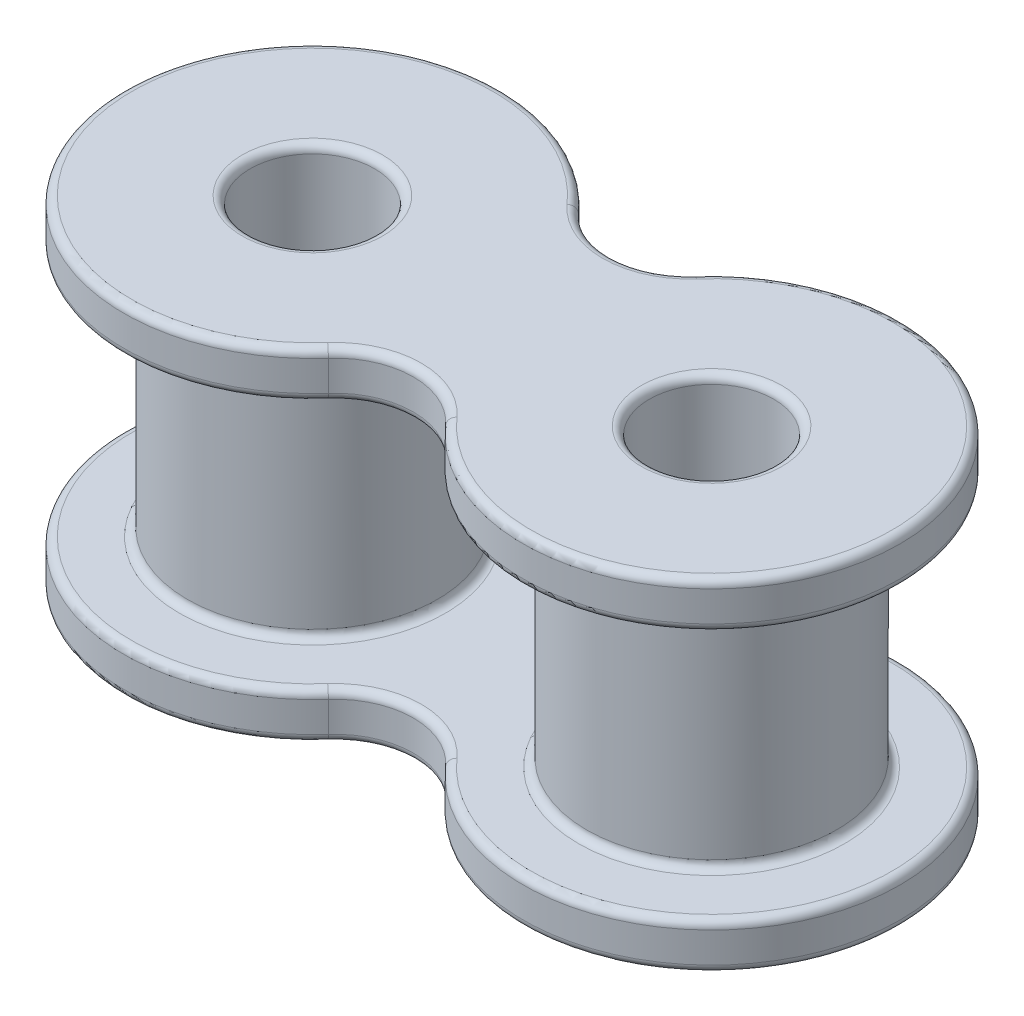
ISO-10303-21;
HEADER;
FILE_DESCRIPTION(('STEP AP214'),'2;1');
FILE_NAME('part.step','',(''),(''),'','','');
FILE_SCHEMA(('AUTOMOTIVE_DESIGN { 1 0 10303 214 1 1 1 1 }'));
ENDSEC;
DATA;
#1=APPLICATION_CONTEXT('core data for automotive mechanical design processes');
#2=APPLICATION_PROTOCOL_DEFINITION('international standard','automotive_design',2000,#1);
#3=PRODUCT_CONTEXT('',#1,'mechanical');
#4=PRODUCT('Part','Part','',(#3));
#5=PRODUCT_RELATED_PRODUCT_CATEGORY('part','',(#4));
#6=PRODUCT_DEFINITION_FORMATION('','',#4);
#7=PRODUCT_DEFINITION_CONTEXT('part definition',#1,'design');
#8=PRODUCT_DEFINITION('design','',#6,#7);
#9=PRODUCT_DEFINITION_SHAPE('','',#8);
#10=(LENGTH_UNIT() NAMED_UNIT(*) SI_UNIT(.MILLI.,.METRE.));
#11=(NAMED_UNIT(*) PLANE_ANGLE_UNIT() SI_UNIT($,.RADIAN.));
#12=(NAMED_UNIT(*) SI_UNIT($,.STERADIAN.) SOLID_ANGLE_UNIT());
#13=UNCERTAINTY_MEASURE_WITH_UNIT(LENGTH_MEASURE(1.E-05),#10,'distance_accuracy_value','');
#14=(GEOMETRIC_REPRESENTATION_CONTEXT(3) GLOBAL_UNCERTAINTY_ASSIGNED_CONTEXT((#13)) GLOBAL_UNIT_ASSIGNED_CONTEXT((#10,
#11,#12)) REPRESENTATION_CONTEXT('',''));
#15=CARTESIAN_POINT('',(0.,0.,0.));
#16=DIRECTION('',(0.,0.,1.));
#17=DIRECTION('',(1.,0.,0.));
#18=AXIS2_PLACEMENT_3D('',#15,#16,#17);
#19=CARTESIAN_POINT('',(3.175,0.7366,-2.81610900547326));
#20=DIRECTION('',(0.,1.,0.));
#21=DIRECTION('',(0.,0.,1.));
#22=AXIS2_PLACEMENT_3D('',#19,#20,#21);
#23=PLANE('',#22);
#24=CARTESIAN_POINT('',(-6.35,0.7366,0.));
#25=DIRECTION('',(0.,1.,0.));
#26=DIRECTION('',(0.,0.,1.));
#27=AXIS2_PLACEMENT_3D('',#24,#25,#26);
#28=CIRCLE('',#27,4.2291);
#29=CARTESIAN_POINT('',(-6.35,0.7366,4.2291));
#30=VERTEX_POINT('',#29);
#31=EDGE_CURVE('E188',#30,#30,#28,.F.);
#32=ORIENTED_EDGE('',*,*,#31,.T.);
#33=EDGE_LOOP('',(#32));
#34=FACE_BOUND('',#33,.T.);
#35=CARTESIAN_POINT('',(6.35,0.7366,0.));
#36=DIRECTION('',(0.,1.,0.));
#37=DIRECTION('',(0.,0.,1.));
#38=AXIS2_PLACEMENT_3D('',#35,#36,#37);
#39=CIRCLE('',#38,4.2291);
#40=CARTESIAN_POINT('',(6.35,0.7366,4.2291));
#41=VERTEX_POINT('',#40);
#42=EDGE_CURVE('E185',#41,#41,#39,.F.);
#43=ORIENTED_EDGE('',*,*,#42,.T.);
#44=EDGE_LOOP('',(#43));
#45=FACE_BOUND('',#44,.T.);
#46=CARTESIAN_POINT('',(6.35,0.7366,0.));
#47=DIRECTION('',(0.,1.,0.));
#48=DIRECTION('',(0.,0.,1.));
#49=AXIS2_PLACEMENT_3D('',#46,#47,#48);
#50=CIRCLE('',#49,5.7404);
#51=CARTESIAN_POINT('',(2.05546815225198,0.7366,3.80909285377477));
#52=VERTEX_POINT('',#51);
#53=CARTESIAN_POINT('',(2.05546815225198,0.7366,-3.80909285377477));
#54=VERTEX_POINT('',#53);
#55=EDGE_CURVE('E183',#52,#54,#50,.T.);
#56=ORIENTED_EDGE('',*,*,#55,.T.);
#57=CARTESIAN_POINT('',(0.,0.7366,-5.63221801094651));
#58=DIRECTION('',(0.,1.,0.));
#59=DIRECTION('',(0.,0.,1.));
#60=AXIS2_PLACEMENT_3D('',#57,#58,#59);
#61=CIRCLE('',#60,2.74749607163225);
#62=CARTESIAN_POINT('',(-2.05546815225198,0.7366,-3.80909285377477));
#63=VERTEX_POINT('',#62);
#64=EDGE_CURVE('E164',#54,#63,#61,.F.);
#65=ORIENTED_EDGE('',*,*,#64,.T.);
#66=CARTESIAN_POINT('',(-6.35,0.7366,0.));
#67=DIRECTION('',(0.,1.,0.));
#68=DIRECTION('',(0.,0.,1.));
#69=AXIS2_PLACEMENT_3D('',#66,#67,#68);
#70=CIRCLE('',#69,5.7404);
#71=CARTESIAN_POINT('',(-2.05546815225198,0.7366,3.80909285377477));
#72=VERTEX_POINT('',#71);
#73=EDGE_CURVE('E173',#63,#72,#70,.T.);
#74=ORIENTED_EDGE('',*,*,#73,.T.);
#75=CARTESIAN_POINT('',(0.,0.7366,5.63221801094651));
#76=DIRECTION('',(0.,1.,0.));
#77=DIRECTION('',(0.,0.,1.));
#78=AXIS2_PLACEMENT_3D('',#75,#76,#77);
#79=CIRCLE('',#78,2.74749607163225);
#80=EDGE_CURVE('E179',#72,#52,#79,.F.);
#81=ORIENTED_EDGE('',*,*,#80,.T.);
#82=EDGE_LOOP('',(#56,#65,#74,#81));
#83=FACE_BOUND('',#82,.T.);
#84=ADVANCED_FACE('F41',(#34,#45,#83),#23,.T.);
#85=CARTESIAN_POINT('',(3.175,-0.7366,-2.81610900547326));
#86=DIRECTION('',(0.,1.,0.));
#87=DIRECTION('',(0.,0.,1.));
#88=AXIS2_PLACEMENT_3D('',#85,#86,#87);
#89=PLANE('',#88);
#90=CARTESIAN_POINT('',(6.35,-0.7366,0.));
#91=DIRECTION('',(0.,1.,0.));
#92=DIRECTION('',(0.,0.,1.));
#93=AXIS2_PLACEMENT_3D('',#90,#91,#92);
#94=CIRCLE('',#93,2.2352);
#95=CARTESIAN_POINT('',(6.35,-0.7366,2.2352));
#96=VERTEX_POINT('',#95);
#97=EDGE_CURVE('E223',#96,#96,#94,.T.);
#98=ORIENTED_EDGE('',*,*,#97,.T.);
#99=EDGE_LOOP('',(#98));
#100=FACE_BOUND('',#99,.T.);
#101=CARTESIAN_POINT('',(-6.35,-0.7366,0.));
#102=DIRECTION('',(0.,1.,0.));
#103=DIRECTION('',(0.,0.,1.));
#104=AXIS2_PLACEMENT_3D('',#101,#102,#103);
#105=CIRCLE('',#104,2.2352);
#106=CARTESIAN_POINT('',(-6.35,-0.7366,2.2352));
#107=VERTEX_POINT('',#106);
#108=EDGE_CURVE('E220',#107,#107,#105,.T.);
#109=ORIENTED_EDGE('',*,*,#108,.T.);
#110=EDGE_LOOP('',(#109));
#111=FACE_BOUND('',#110,.T.);
#112=CARTESIAN_POINT('',(0.,-0.7366,5.63221801094651));
#113=DIRECTION('',(0.,1.,0.));
#114=DIRECTION('',(0.,0.,1.));
#115=AXIS2_PLACEMENT_3D('',#112,#113,#114);
#116=CIRCLE('',#115,2.74749607163225);
#117=CARTESIAN_POINT('',(2.05546815225198,-0.7366,3.80909285377476));
#118=VERTEX_POINT('',#117);
#119=CARTESIAN_POINT('',(-2.05546815225198,-0.7366,3.80909285377476));
#120=VERTEX_POINT('',#119);
#121=EDGE_CURVE('E213',#118,#120,#116,.T.);
#122=ORIENTED_EDGE('',*,*,#121,.T.);
#123=CARTESIAN_POINT('',(-6.35,-0.7366,0.));
#124=DIRECTION('',(0.,1.,0.));
#125=DIRECTION('',(0.,0.,1.));
#126=AXIS2_PLACEMENT_3D('',#123,#124,#125);
#127=CIRCLE('',#126,5.7404);
#128=CARTESIAN_POINT('',(-2.05546815225198,-0.7366,-3.80909285377477));
#129=VERTEX_POINT('',#128);
#130=EDGE_CURVE('E217',#120,#129,#127,.F.);
#131=ORIENTED_EDGE('',*,*,#130,.T.);
#132=CARTESIAN_POINT('',(0.,-0.7366,-5.63221801094651));
#133=DIRECTION('',(0.,1.,0.));
#134=DIRECTION('',(0.,0.,1.));
#135=AXIS2_PLACEMENT_3D('',#132,#133,#134);
#136=CIRCLE('',#135,2.74749607163225);
#137=CARTESIAN_POINT('',(2.05546815225198,-0.7366,-3.80909285377477));
#138=VERTEX_POINT('',#137);
#139=EDGE_CURVE('E215',#129,#138,#136,.T.);
#140=ORIENTED_EDGE('',*,*,#139,.T.);
#141=CARTESIAN_POINT('',(6.35,-0.7366,0.));
#142=DIRECTION('',(0.,1.,0.));
#143=DIRECTION('',(0.,0.,1.));
#144=AXIS2_PLACEMENT_3D('',#141,#142,#143);
#145=CIRCLE('',#144,5.7404);
#146=EDGE_CURVE('E211',#138,#118,#145,.F.);
#147=ORIENTED_EDGE('',*,*,#146,.T.);
#148=EDGE_LOOP('',(#122,#131,#140,#147));
#149=FACE_BOUND('',#148,.T.);
#150=ADVANCED_FACE('F391',(#100,#111,#149),#89,.F.);
#151=CARTESIAN_POINT('',(0.,0.7366,-5.63221801094651));
#152=DIRECTION('',(0.,-1.,0.));
#153=DIRECTION('',(0.,0.,-1.));
#154=AXIS2_PLACEMENT_3D('',#151,#152,#153);
#155=CYLINDRICAL_SURFACE('',#154,2.49349607163225);
#156=DIRECTION('',(0.,-1.,0.));
#157=VECTOR('',#156,1.);
#158=CARTESIAN_POINT('',(-1.86544461916579,0.7366,-3.97763678535772));
#159=LINE('',#158,#157);
#160=CARTESIAN_POINT('',(-1.86544461916579,0.4826,-3.97763678535772));
#161=VERTEX_POINT('',#160);
#162=CARTESIAN_POINT('',(-1.86544461916579,-0.4826,-3.97763678535772));
#163=VERTEX_POINT('',#162);
#164=EDGE_CURVE('E180',#161,#163,#159,.T.);
#165=ORIENTED_EDGE('',*,*,#164,.F.);
#166=CARTESIAN_POINT('',(0.,0.4826,-5.63221801094651));
#167=DIRECTION('',(0.,1.,0.));
#168=DIRECTION('',(0.,0.,1.));
#169=AXIS2_PLACEMENT_3D('',#166,#167,#168);
#170=CIRCLE('',#169,2.49349607163225);
#171=CARTESIAN_POINT('',(1.86544461916579,0.4826,-3.97763678535772));
#172=VERTEX_POINT('',#171);
#173=EDGE_CURVE('E166',#161,#172,#170,.T.);
#174=ORIENTED_EDGE('',*,*,#173,.T.);
#175=DIRECTION('',(0.,-1.,0.));
#176=VECTOR('',#175,1.);
#177=CARTESIAN_POINT('',(1.86544461916579,0.7366,-3.97763678535772));
#178=LINE('',#177,#176);
#179=CARTESIAN_POINT('',(1.86544461916579,-0.4826,-3.97763678535772));
#180=VERTEX_POINT('',#179);
#181=EDGE_CURVE('E244',#172,#180,#178,.T.);
#182=ORIENTED_EDGE('',*,*,#181,.T.);
#183=CARTESIAN_POINT('',(0.,-0.4826,-5.63221801094651));
#184=DIRECTION('',(0.,1.,0.));
#185=DIRECTION('',(0.,0.,1.));
#186=AXIS2_PLACEMENT_3D('',#183,#184,#185);
#187=CIRCLE('',#186,2.49349607163225);
#188=EDGE_CURVE('E195',#180,#163,#187,.F.);
#189=ORIENTED_EDGE('',*,*,#188,.T.);
#190=EDGE_LOOP('',(#165,#174,#182,#189));
#191=FACE_BOUND('',#190,.T.);
#192=ADVANCED_FACE('F375',(#191),#155,.F.);
#193=CARTESIAN_POINT('',(-6.35,0.7366,0.));
#194=DIRECTION('',(0.,-1.,0.));
#195=DIRECTION('',(0.,0.,-1.));
#196=AXIS2_PLACEMENT_3D('',#193,#194,#195);
#197=CYLINDRICAL_SURFACE('',#196,5.9944);
#198=ORIENTED_EDGE('',*,*,#164,.T.);
#199=CARTESIAN_POINT('',(-6.35,-0.4826,0.));
#200=DIRECTION('',(0.,1.,0.));
#201=DIRECTION('',(0.,0.,1.));
#202=AXIS2_PLACEMENT_3D('',#199,#200,#201);
#203=CIRCLE('',#202,5.9944);
#204=CARTESIAN_POINT('',(-1.86544461916578,-0.4826,3.97763678535772));
#205=VERTEX_POINT('',#204);
#206=EDGE_CURVE('E208',#163,#205,#203,.T.);
#207=ORIENTED_EDGE('',*,*,#206,.T.);
#208=DIRECTION('',(0.,-1.,0.));
#209=VECTOR('',#208,1.);
#210=CARTESIAN_POINT('',(-1.86544461916578,0.7366,3.97763678535772));
#211=LINE('',#210,#209);
#212=CARTESIAN_POINT('',(-1.86544461916578,0.4826,3.97763678535772));
#213=VERTEX_POINT('',#212);
#214=EDGE_CURVE('E359',#213,#205,#211,.T.);
#215=ORIENTED_EDGE('',*,*,#214,.F.);
#216=CARTESIAN_POINT('',(-6.35,0.4826,0.));
#217=DIRECTION('',(0.,1.,0.));
#218=DIRECTION('',(0.,0.,1.));
#219=AXIS2_PLACEMENT_3D('',#216,#217,#218);
#220=CIRCLE('',#219,5.9944);
#221=EDGE_CURVE('E206',#213,#161,#220,.F.);
#222=ORIENTED_EDGE('',*,*,#221,.T.);
#223=EDGE_LOOP('',(#198,#207,#215,#222));
#224=FACE_BOUND('',#223,.T.);
#225=ADVANCED_FACE('F400',(#224),#197,.T.);
#226=CARTESIAN_POINT('',(0.,0.7366,5.63221801094651));
#227=DIRECTION('',(0.,-1.,0.));
#228=DIRECTION('',(0.,0.,-1.));
#229=AXIS2_PLACEMENT_3D('',#226,#227,#228);
#230=CYLINDRICAL_SURFACE('',#229,2.49349607163225);
#231=DIRECTION('',(0.,-1.,0.));
#232=VECTOR('',#231,1.);
#233=CARTESIAN_POINT('',(1.86544461916579,0.7366,3.97763678535772));
#234=LINE('',#233,#232);
#235=CARTESIAN_POINT('',(1.86544461916579,0.4826,3.97763678535772));
#236=VERTEX_POINT('',#235);
#237=CARTESIAN_POINT('',(1.86544461916579,-0.4826,3.97763678535772));
#238=VERTEX_POINT('',#237);
#239=EDGE_CURVE('E356',#236,#238,#234,.T.);
#240=ORIENTED_EDGE('',*,*,#239,.F.);
#241=CARTESIAN_POINT('',(0.,0.4826,5.63221801094651));
#242=DIRECTION('',(0.,1.,0.));
#243=DIRECTION('',(0.,0.,1.));
#244=AXIS2_PLACEMENT_3D('',#241,#242,#243);
#245=CIRCLE('',#244,2.49349607163225);
#246=EDGE_CURVE('E204',#236,#213,#245,.T.);
#247=ORIENTED_EDGE('',*,*,#246,.T.);
#248=ORIENTED_EDGE('',*,*,#214,.T.);
#249=CARTESIAN_POINT('',(0.,-0.4826,5.63221801094651));
#250=DIRECTION('',(0.,1.,0.));
#251=DIRECTION('',(0.,0.,1.));
#252=AXIS2_PLACEMENT_3D('',#249,#250,#251);
#253=CIRCLE('',#252,2.49349607163225);
#254=EDGE_CURVE('E202',#205,#238,#253,.F.);
#255=ORIENTED_EDGE('',*,*,#254,.T.);
#256=EDGE_LOOP('',(#240,#247,#248,#255));
#257=FACE_BOUND('',#256,.T.);
#258=ADVANCED_FACE('F403',(#257),#230,.F.);
#259=CARTESIAN_POINT('',(6.35,0.7366,0.));
#260=DIRECTION('',(0.,-1.,0.));
#261=DIRECTION('',(0.,0.,-1.));
#262=AXIS2_PLACEMENT_3D('',#259,#260,#261);
#263=CYLINDRICAL_SURFACE('',#262,5.9944);
#264=ORIENTED_EDGE('',*,*,#181,.F.);
#265=CARTESIAN_POINT('',(6.35,0.4826,0.));
#266=DIRECTION('',(0.,1.,0.));
#267=DIRECTION('',(0.,0.,1.));
#268=AXIS2_PLACEMENT_3D('',#265,#266,#267);
#269=CIRCLE('',#268,5.9944);
#270=EDGE_CURVE('E200',#172,#236,#269,.F.);
#271=ORIENTED_EDGE('',*,*,#270,.T.);
#272=ORIENTED_EDGE('',*,*,#239,.T.);
#273=CARTESIAN_POINT('',(6.35,-0.4826,0.));
#274=DIRECTION('',(0.,1.,0.));
#275=DIRECTION('',(0.,0.,1.));
#276=AXIS2_PLACEMENT_3D('',#273,#274,#275);
#277=CIRCLE('',#276,5.9944);
#278=EDGE_CURVE('E198',#238,#180,#277,.T.);
#279=ORIENTED_EDGE('',*,*,#278,.T.);
#280=EDGE_LOOP('',(#264,#271,#272,#279));
#281=FACE_BOUND('',#280,.T.);
#282=ADVANCED_FACE('F377',(#281),#263,.T.);
#283=CARTESIAN_POINT('',(-6.35,0.7366,0.));
#284=DIRECTION('',(0.,-1.,0.));
#285=DIRECTION('',(0.,0.,-1.));
#286=AXIS2_PLACEMENT_3D('',#283,#284,#285);
#287=CYLINDRICAL_SURFACE('',#286,1.9812);
#288=CARTESIAN_POINT('',(-6.35,9.8806,0.));
#289=DIRECTION('',(0.,-1.,0.));
#290=DIRECTION('',(0.,0.,-1.));
#291=AXIS2_PLACEMENT_3D('',#288,#289,#290);
#292=CIRCLE('',#291,1.9812);
#293=CARTESIAN_POINT('',(-6.35,9.8806,-1.9812));
#294=VERTEX_POINT('',#293);
#295=EDGE_CURVE('E11',#294,#294,#292,.F.);
#296=ORIENTED_EDGE('',*,*,#295,.T.);
#297=EDGE_LOOP('',(#296));
#298=FACE_BOUND('',#297,.T.);
#299=CARTESIAN_POINT('',(-6.35,-0.4826,0.));
#300=DIRECTION('',(0.,1.,0.));
#301=DIRECTION('',(0.,0.,1.));
#302=AXIS2_PLACEMENT_3D('',#299,#300,#301);
#303=CIRCLE('',#302,1.9812);
#304=CARTESIAN_POINT('',(-6.35,-0.4826,1.9812));
#305=VERTEX_POINT('',#304);
#306=EDGE_CURVE('E235',#305,#305,#303,.F.);
#307=ORIENTED_EDGE('',*,*,#306,.T.);
#308=EDGE_LOOP('',(#307));
#309=FACE_BOUND('',#308,.T.);
#310=ADVANCED_FACE('F410',(#298,#309),#287,.F.);
#311=CARTESIAN_POINT('',(6.35,0.7366,0.));
#312=DIRECTION('',(0.,-1.,0.));
#313=DIRECTION('',(0.,0.,-1.));
#314=AXIS2_PLACEMENT_3D('',#311,#312,#313);
#315=CYLINDRICAL_SURFACE('',#314,1.9812);
#316=CARTESIAN_POINT('',(6.35,9.8806,0.));
#317=DIRECTION('',(0.,-1.,0.));
#318=DIRECTION('',(0.,0.,-1.));
#319=AXIS2_PLACEMENT_3D('',#316,#317,#318);
#320=CIRCLE('',#319,1.9812);
#321=CARTESIAN_POINT('',(6.35,9.8806,-1.9812));
#322=VERTEX_POINT('',#321);
#323=EDGE_CURVE('E50',#322,#322,#320,.F.);
#324=ORIENTED_EDGE('',*,*,#323,.T.);
#325=EDGE_LOOP('',(#324));
#326=FACE_BOUND('',#325,.T.);
#327=CARTESIAN_POINT('',(6.35,-0.4826,0.));
#328=DIRECTION('',(0.,1.,0.));
#329=DIRECTION('',(0.,0.,1.));
#330=AXIS2_PLACEMENT_3D('',#327,#328,#329);
#331=CIRCLE('',#330,1.9812);
#332=CARTESIAN_POINT('',(6.35,-0.4826,1.9812));
#333=VERTEX_POINT('',#332);
#334=EDGE_CURVE('E232',#333,#333,#331,.F.);
#335=ORIENTED_EDGE('',*,*,#334,.T.);
#336=EDGE_LOOP('',(#335));
#337=FACE_BOUND('',#336,.T.);
#338=ADVANCED_FACE('F425',(#326,#337),#315,.F.);
#339=CARTESIAN_POINT('',(6.35,8.6614,0.));
#340=DIRECTION('',(0.,-1.,0.));
#341=DIRECTION('',(0.,0.,-1.));
#342=AXIS2_PLACEMENT_3D('',#339,#340,#341);
#343=CYLINDRICAL_SURFACE('',#342,3.9751);
#344=CARTESIAN_POINT('',(6.35,8.4074,0.));
#345=DIRECTION('',(0.,-1.,0.));
#346=DIRECTION('',(0.,0.,-1.));
#347=AXIS2_PLACEMENT_3D('',#344,#345,#346);
#348=CIRCLE('',#347,3.9751);
#349=CARTESIAN_POINT('',(6.35,8.4074,-3.9751));
#350=VERTEX_POINT('',#349);
#351=EDGE_CURVE('E303',#350,#350,#348,.T.);
#352=ORIENTED_EDGE('',*,*,#351,.T.);
#353=EDGE_LOOP('',(#352));
#354=FACE_BOUND('',#353,.T.);
#355=CARTESIAN_POINT('',(6.35,0.990599999999999,0.));
#356=DIRECTION('',(0.,1.,0.));
#357=DIRECTION('',(0.,0.,1.));
#358=AXIS2_PLACEMENT_3D('',#355,#356,#357);
#359=CIRCLE('',#358,3.9751);
#360=CARTESIAN_POINT('',(6.35,0.990599999999999,3.9751));
#361=VERTEX_POINT('',#360);
#362=EDGE_CURVE('E229',#361,#361,#359,.T.);
#363=ORIENTED_EDGE('',*,*,#362,.T.);
#364=EDGE_LOOP('',(#363));
#365=FACE_BOUND('',#364,.T.);
#366=ADVANCED_FACE('F429',(#354,#365),#343,.T.);
#367=CARTESIAN_POINT('',(-6.35,8.6614,0.));
#368=DIRECTION('',(0.,-1.,0.));
#369=DIRECTION('',(0.,0.,-1.));
#370=AXIS2_PLACEMENT_3D('',#367,#368,#369);
#371=CYLINDRICAL_SURFACE('',#370,3.9751);
#372=CARTESIAN_POINT('',(-6.35,8.4074,0.));
#373=DIRECTION('',(0.,-1.,0.));
#374=DIRECTION('',(0.,0.,-1.));
#375=AXIS2_PLACEMENT_3D('',#372,#373,#374);
#376=CIRCLE('',#375,3.9751);
#377=CARTESIAN_POINT('',(-6.35,8.4074,-3.9751));
#378=VERTEX_POINT('',#377);
#379=EDGE_CURVE('E300',#378,#378,#376,.T.);
#380=ORIENTED_EDGE('',*,*,#379,.T.);
#381=EDGE_LOOP('',(#380));
#382=FACE_BOUND('',#381,.T.);
#383=CARTESIAN_POINT('',(-6.35,0.990599999999999,0.));
#384=DIRECTION('',(0.,1.,0.));
#385=DIRECTION('',(0.,0.,1.));
#386=AXIS2_PLACEMENT_3D('',#383,#384,#385);
#387=CIRCLE('',#386,3.9751);
#388=CARTESIAN_POINT('',(-6.35,0.990599999999999,3.9751));
#389=VERTEX_POINT('',#388);
#390=EDGE_CURVE('E226',#389,#389,#387,.T.);
#391=ORIENTED_EDGE('',*,*,#390,.T.);
#392=EDGE_LOOP('',(#391));
#393=FACE_BOUND('',#392,.T.);
#394=ADVANCED_FACE('F433',(#382,#393),#371,.T.);
#395=CARTESIAN_POINT('',(0.,0.4826,5.63221801094651));
#396=DIRECTION('',(0.,1.,0.));
#397=DIRECTION('',(0.,0.,1.));
#398=AXIS2_PLACEMENT_3D('',#395,#396,#397);
#399=TOROIDAL_SURFACE('',#398,2.74749607163225,0.254);
#400=CARTESIAN_POINT('',(-2.05546815225198,0.4826,3.80909285377476));
#401=DIRECTION('',(-0.663558785759664,0.,0.748124146008642));
#402=DIRECTION('',(0.748124146008642,0.,0.663558785759664));
#403=AXIS2_PLACEMENT_3D('',#400,#401,#402);
#404=CIRCLE('',#403,0.254);
#405=EDGE_CURVE('E176',#213,#72,#404,.T.);
#406=ORIENTED_EDGE('',*,*,#405,.F.);
#407=ORIENTED_EDGE('',*,*,#246,.F.);
#408=CARTESIAN_POINT('',(2.05546815225198,0.4826,3.80909285377477));
#409=DIRECTION('',(0.663558785759662,0.,0.748124146008644));
#410=DIRECTION('',(0.748124146008644,0.,-0.663558785759662));
#411=AXIS2_PLACEMENT_3D('',#408,#409,#410);
#412=CIRCLE('',#411,0.254);
#413=EDGE_CURVE('E241',#52,#236,#412,.T.);
#414=ORIENTED_EDGE('',*,*,#413,.F.);
#415=ORIENTED_EDGE('',*,*,#80,.F.);
#416=EDGE_LOOP('',(#406,#407,#414,#415));
#417=FACE_BOUND('',#416,.T.);
#418=ADVANCED_FACE('F366',(#417),#399,.T.);
#419=CARTESIAN_POINT('',(6.35,0.4826,0.));
#420=DIRECTION('',(0.,1.,0.));
#421=DIRECTION('',(0.,0.,1.));
#422=AXIS2_PLACEMENT_3D('',#419,#420,#421);
#423=TOROIDAL_SURFACE('',#422,5.7404,0.254);
#424=ORIENTED_EDGE('',*,*,#413,.T.);
#425=ORIENTED_EDGE('',*,*,#270,.F.);
#426=CARTESIAN_POINT('',(2.05546815225198,0.4826,-3.80909285377477));
#427=DIRECTION('',(-0.663558785759663,0.,0.748124146008643));
#428=DIRECTION('',(0.748124146008643,0.,0.663558785759663));
#429=AXIS2_PLACEMENT_3D('',#426,#427,#428);
#430=CIRCLE('',#429,0.254);
#431=EDGE_CURVE('E169',#54,#172,#430,.T.);
#432=ORIENTED_EDGE('',*,*,#431,.F.);
#433=ORIENTED_EDGE('',*,*,#55,.F.);
#434=EDGE_LOOP('',(#424,#425,#432,#433));
#435=FACE_BOUND('',#434,.T.);
#436=ADVANCED_FACE('F369',(#435),#423,.T.);
#437=CARTESIAN_POINT('',(-6.35,0.4826,0.));
#438=DIRECTION('',(0.,1.,0.));
#439=DIRECTION('',(0.,0.,1.));
#440=AXIS2_PLACEMENT_3D('',#437,#438,#439);
#441=TOROIDAL_SURFACE('',#440,5.7404,0.254);
#442=ORIENTED_EDGE('',*,*,#405,.T.);
#443=ORIENTED_EDGE('',*,*,#73,.F.);
#444=CARTESIAN_POINT('',(-2.05546815225198,0.4826,-3.80909285377477));
#445=DIRECTION('',(0.663558785759663,0.,0.748124146008643));
#446=DIRECTION('',(0.748124146008643,0.,-0.663558785759663));
#447=AXIS2_PLACEMENT_3D('',#444,#445,#446);
#448=CIRCLE('',#447,0.254);
#449=EDGE_CURVE('E160',#161,#63,#448,.T.);
#450=ORIENTED_EDGE('',*,*,#449,.F.);
#451=ORIENTED_EDGE('',*,*,#221,.F.);
#452=EDGE_LOOP('',(#442,#443,#450,#451));
#453=FACE_BOUND('',#452,.T.);
#454=ADVANCED_FACE('F174',(#453),#441,.T.);
#455=CARTESIAN_POINT('',(0.,0.4826,-5.63221801094651));
#456=DIRECTION('',(0.,1.,0.));
#457=DIRECTION('',(0.,0.,1.));
#458=AXIS2_PLACEMENT_3D('',#455,#456,#457);
#459=TOROIDAL_SURFACE('',#458,2.74749607163225,0.254);
#460=ORIENTED_EDGE('',*,*,#431,.T.);
#461=ORIENTED_EDGE('',*,*,#173,.F.);
#462=ORIENTED_EDGE('',*,*,#449,.T.);
#463=ORIENTED_EDGE('',*,*,#64,.F.);
#464=EDGE_LOOP('',(#460,#461,#462,#463));
#465=FACE_BOUND('',#464,.T.);
#466=ADVANCED_FACE('F162',(#465),#459,.T.);
#467=CARTESIAN_POINT('',(6.35,-0.4826,0.));
#468=DIRECTION('',(0.,1.,0.));
#469=DIRECTION('',(0.,0.,1.));
#470=AXIS2_PLACEMENT_3D('',#467,#468,#469);
#471=TOROIDAL_SURFACE('',#470,5.7404,0.254);
#472=CARTESIAN_POINT('',(2.05546815225198,-0.4826,3.80909285377476));
#473=DIRECTION('',(-0.663558785759664,0.,-0.748124146008643));
#474=DIRECTION('',(-0.748124146008643,0.,0.663558785759664));
#475=AXIS2_PLACEMENT_3D('',#472,#473,#474);
#476=CIRCLE('',#475,0.254);
#477=EDGE_CURVE('E250',#118,#238,#476,.T.);
#478=ORIENTED_EDGE('',*,*,#477,.F.);
#479=ORIENTED_EDGE('',*,*,#146,.F.);
#480=CARTESIAN_POINT('',(2.05546815225198,-0.4826,-3.80909285377477));
#481=DIRECTION('',(-0.663558785759662,0.,0.748124146008644));
#482=DIRECTION('',(0.748124146008644,0.,0.663558785759662));
#483=AXIS2_PLACEMENT_3D('',#480,#481,#482);
#484=CIRCLE('',#483,0.254);
#485=EDGE_CURVE('E170',#180,#138,#484,.T.);
#486=ORIENTED_EDGE('',*,*,#485,.F.);
#487=ORIENTED_EDGE('',*,*,#278,.F.);
#488=EDGE_LOOP('',(#478,#479,#486,#487));
#489=FACE_BOUND('',#488,.T.);
#490=ADVANCED_FACE('F381',(#489),#471,.T.);
#491=CARTESIAN_POINT('',(0.,-0.4826,-5.63221801094651));
#492=DIRECTION('',(0.,1.,0.));
#493=DIRECTION('',(0.,0.,1.));
#494=AXIS2_PLACEMENT_3D('',#491,#492,#493);
#495=TOROIDAL_SURFACE('',#494,2.74749607163225,0.254);
#496=ORIENTED_EDGE('',*,*,#485,.T.);
#497=ORIENTED_EDGE('',*,*,#139,.F.);
#498=CARTESIAN_POINT('',(-2.05546815225198,-0.4826,-3.80909285377477));
#499=DIRECTION('',(-0.663558785759663,0.,-0.748124146008643));
#500=DIRECTION('',(-0.748124146008643,0.,0.663558785759663));
#501=AXIS2_PLACEMENT_3D('',#498,#499,#500);
#502=CIRCLE('',#501,0.254);
#503=EDGE_CURVE('E247',#163,#129,#502,.T.);
#504=ORIENTED_EDGE('',*,*,#503,.F.);
#505=ORIENTED_EDGE('',*,*,#188,.F.);
#506=EDGE_LOOP('',(#496,#497,#504,#505));
#507=FACE_BOUND('',#506,.T.);
#508=ADVANCED_FACE('F398',(#507),#495,.T.);
#509=CARTESIAN_POINT('',(0.,-0.4826,5.63221801094651));
#510=DIRECTION('',(0.,1.,0.));
#511=DIRECTION('',(0.,0.,1.));
#512=AXIS2_PLACEMENT_3D('',#509,#510,#511);
#513=TOROIDAL_SURFACE('',#512,2.74749607163225,0.254);
#514=ORIENTED_EDGE('',*,*,#477,.T.);
#515=ORIENTED_EDGE('',*,*,#254,.F.);
#516=CARTESIAN_POINT('',(-2.05546815225198,-0.4826,3.80909285377476));
#517=DIRECTION('',(-0.663558785759662,0.,0.748124146008644));
#518=DIRECTION('',(0.748124146008644,0.,0.663558785759662));
#519=AXIS2_PLACEMENT_3D('',#516,#517,#518);
#520=CIRCLE('',#519,0.254);
#521=EDGE_CURVE('E245',#120,#205,#520,.T.);
#522=ORIENTED_EDGE('',*,*,#521,.F.);
#523=ORIENTED_EDGE('',*,*,#121,.F.);
#524=EDGE_LOOP('',(#514,#515,#522,#523));
#525=FACE_BOUND('',#524,.T.);
#526=ADVANCED_FACE('F387',(#525),#513,.T.);
#527=CARTESIAN_POINT('',(-6.35,-0.4826,0.));
#528=DIRECTION('',(0.,1.,0.));
#529=DIRECTION('',(0.,0.,1.));
#530=AXIS2_PLACEMENT_3D('',#527,#528,#529);
#531=TOROIDAL_SURFACE('',#530,5.7404,0.254);
#532=ORIENTED_EDGE('',*,*,#503,.T.);
#533=ORIENTED_EDGE('',*,*,#130,.F.);
#534=ORIENTED_EDGE('',*,*,#521,.T.);
#535=ORIENTED_EDGE('',*,*,#206,.F.);
#536=EDGE_LOOP('',(#532,#533,#534,#535));
#537=FACE_BOUND('',#536,.T.);
#538=ADVANCED_FACE('F393',(#537),#531,.T.);
#539=CARTESIAN_POINT('',(-6.35,0.990599999999999,0.));
#540=DIRECTION('',(0.,1.,0.));
#541=DIRECTION('',(0.,0.,1.));
#542=AXIS2_PLACEMENT_3D('',#539,#540,#541);
#543=TOROIDAL_SURFACE('',#542,4.2291,0.254);
#544=ORIENTED_EDGE('',*,*,#31,.F.);
#545=EDGE_LOOP('',(#544));
#546=FACE_BOUND('',#545,.T.);
#547=ORIENTED_EDGE('',*,*,#390,.F.);
#548=EDGE_LOOP('',(#547));
#549=FACE_BOUND('',#548,.T.);
#550=ADVANCED_FACE('F676',(#546,#549),#543,.F.);
#551=CARTESIAN_POINT('',(6.35,0.990599999999999,0.));
#552=DIRECTION('',(0.,1.,0.));
#553=DIRECTION('',(0.,0.,1.));
#554=AXIS2_PLACEMENT_3D('',#551,#552,#553);
#555=TOROIDAL_SURFACE('',#554,4.2291,0.254);
#556=ORIENTED_EDGE('',*,*,#42,.F.);
#557=EDGE_LOOP('',(#556));
#558=FACE_BOUND('',#557,.T.);
#559=ORIENTED_EDGE('',*,*,#362,.F.);
#560=EDGE_LOOP('',(#559));
#561=FACE_BOUND('',#560,.T.);
#562=ADVANCED_FACE('F517',(#558,#561),#555,.F.);
#563=CARTESIAN_POINT('',(6.35,-0.4826,0.));
#564=DIRECTION('',(0.,1.,0.));
#565=DIRECTION('',(0.,0.,1.));
#566=AXIS2_PLACEMENT_3D('',#563,#564,#565);
#567=TOROIDAL_SURFACE('',#566,2.2352,0.254);
#568=ORIENTED_EDGE('',*,*,#334,.F.);
#569=EDGE_LOOP('',(#568));
#570=FACE_BOUND('',#569,.T.);
#571=ORIENTED_EDGE('',*,*,#97,.F.);
#572=EDGE_LOOP('',(#571));
#573=FACE_BOUND('',#572,.T.);
#574=ADVANCED_FACE('F514',(#570,#573),#567,.T.);
#575=CARTESIAN_POINT('',(-6.35,-0.4826,0.));
#576=DIRECTION('',(0.,1.,0.));
#577=DIRECTION('',(0.,0.,1.));
#578=AXIS2_PLACEMENT_3D('',#575,#576,#577);
#579=TOROIDAL_SURFACE('',#578,2.2352,0.254);
#580=ORIENTED_EDGE('',*,*,#306,.F.);
#581=EDGE_LOOP('',(#580));
#582=FACE_BOUND('',#581,.T.);
#583=ORIENTED_EDGE('',*,*,#108,.F.);
#584=EDGE_LOOP('',(#583));
#585=FACE_BOUND('',#584,.T.);
#586=ADVANCED_FACE('F441',(#582,#585),#579,.T.);
#587=CARTESIAN_POINT('',(0.,8.6614,-5.63221801094651));
#588=DIRECTION('',(0.,1.,0.));
#589=DIRECTION('',(0.,0.,1.));
#590=AXIS2_PLACEMENT_3D('',#587,#588,#589);
#591=CYLINDRICAL_SURFACE('',#590,2.49349607163225);
#592=DIRECTION('',(0.,1.,0.));
#593=VECTOR('',#592,1.);
#594=CARTESIAN_POINT('',(1.86544461916579,8.6614,-3.97763678535772));
#595=LINE('',#594,#593);
#596=CARTESIAN_POINT('',(1.86544461916579,8.9154,-3.97763678535772));
#597=VERTEX_POINT('',#596);
#598=CARTESIAN_POINT('',(1.86544461916579,9.8806,-3.97763678535772));
#599=VERTEX_POINT('',#598);
#600=EDGE_CURVE('E248',#597,#599,#595,.T.);
#601=ORIENTED_EDGE('',*,*,#600,.F.);
#602=CARTESIAN_POINT('',(0.,8.9154,-5.63221801094651));
#603=DIRECTION('',(0.,-1.,0.));
#604=DIRECTION('',(0.,0.,-1.));
#605=AXIS2_PLACEMENT_3D('',#602,#603,#604);
#606=CIRCLE('',#605,2.49349607163225);
#607=CARTESIAN_POINT('',(-1.86544461916579,8.9154,-3.97763678535772));
#608=VERTEX_POINT('',#607);
#609=EDGE_CURVE('E256',#597,#608,#606,.T.);
#610=ORIENTED_EDGE('',*,*,#609,.T.);
#611=DIRECTION('',(0.,1.,0.));
#612=VECTOR('',#611,1.);
#613=CARTESIAN_POINT('',(-1.86544461916579,8.6614,-3.97763678535772));
#614=LINE('',#613,#612);
#615=CARTESIAN_POINT('',(-1.86544461916579,9.8806,-3.97763678535772));
#616=VERTEX_POINT('',#615);
#617=EDGE_CURVE('E318',#608,#616,#614,.T.);
#618=ORIENTED_EDGE('',*,*,#617,.T.);
#619=CARTESIAN_POINT('',(0.,9.8806,-5.63221801094651));
#620=DIRECTION('',(0.,-1.,0.));
#621=DIRECTION('',(0.,0.,-1.));
#622=AXIS2_PLACEMENT_3D('',#619,#620,#621);
#623=CIRCLE('',#622,2.49349607163225);
#624=EDGE_CURVE('E237',#616,#599,#623,.F.);
#625=ORIENTED_EDGE('',*,*,#624,.T.);
#626=EDGE_LOOP('',(#601,#610,#618,#625));
#627=FACE_BOUND('',#626,.T.);
#628=ADVANCED_FACE('F438',(#627),#591,.F.);
#629=CARTESIAN_POINT('',(6.35,8.6614,0.));
#630=DIRECTION('',(0.,1.,0.));
#631=DIRECTION('',(0.,0.,1.));
#632=AXIS2_PLACEMENT_3D('',#629,#630,#631);
#633=CYLINDRICAL_SURFACE('',#632,5.9944);
#634=DIRECTION('',(0.,1.,0.));
#635=VECTOR('',#634,1.);
#636=CARTESIAN_POINT('',(1.86544461916579,8.6614,3.97763678535772));
#637=LINE('',#636,#635);
#638=CARTESIAN_POINT('',(1.86544461916579,8.9154,3.97763678535772));
#639=VERTEX_POINT('',#638);
#640=CARTESIAN_POINT('',(1.86544461916579,9.8806,3.97763678535772));
#641=VERTEX_POINT('',#640);
#642=EDGE_CURVE('E340',#639,#641,#637,.T.);
#643=ORIENTED_EDGE('',*,*,#642,.F.);
#644=CARTESIAN_POINT('',(6.35,8.9154,0.));
#645=DIRECTION('',(0.,-1.,0.));
#646=DIRECTION('',(0.,0.,-1.));
#647=AXIS2_PLACEMENT_3D('',#644,#645,#646);
#648=CIRCLE('',#647,5.9944);
#649=EDGE_CURVE('E276',#639,#597,#648,.F.);
#650=ORIENTED_EDGE('',*,*,#649,.T.);
#651=ORIENTED_EDGE('',*,*,#600,.T.);
#652=CARTESIAN_POINT('',(6.35,9.8806,0.));
#653=DIRECTION('',(0.,-1.,0.));
#654=DIRECTION('',(0.,0.,-1.));
#655=AXIS2_PLACEMENT_3D('',#652,#653,#654);
#656=CIRCLE('',#655,5.9944);
#657=EDGE_CURVE('E274',#599,#641,#656,.T.);
#658=ORIENTED_EDGE('',*,*,#657,.T.);
#659=EDGE_LOOP('',(#643,#650,#651,#658));
#660=FACE_BOUND('',#659,.T.);
#661=ADVANCED_FACE('F339',(#660),#633,.T.);
#662=CARTESIAN_POINT('',(0.,8.6614,5.63221801094651));
#663=DIRECTION('',(0.,1.,0.));
#664=DIRECTION('',(0.,0.,1.));
#665=AXIS2_PLACEMENT_3D('',#662,#663,#664);
#666=CYLINDRICAL_SURFACE('',#665,2.49349607163225);
#667=DIRECTION('',(0.,1.,0.));
#668=VECTOR('',#667,1.);
#669=CARTESIAN_POINT('',(-1.86544461916578,8.6614,3.97763678535772));
#670=LINE('',#669,#668);
#671=CARTESIAN_POINT('',(-1.86544461916578,8.9154,3.97763678535772));
#672=VERTEX_POINT('',#671);
#673=CARTESIAN_POINT('',(-1.86544461916578,9.8806,3.97763678535772));
#674=VERTEX_POINT('',#673);
#675=EDGE_CURVE('E348',#672,#674,#670,.T.);
#676=ORIENTED_EDGE('',*,*,#675,.F.);
#677=CARTESIAN_POINT('',(0.,8.9154,5.63221801094651));
#678=DIRECTION('',(0.,-1.,0.));
#679=DIRECTION('',(0.,0.,-1.));
#680=AXIS2_PLACEMENT_3D('',#677,#678,#679);
#681=CIRCLE('',#680,2.49349607163225);
#682=EDGE_CURVE('E280',#672,#639,#681,.T.);
#683=ORIENTED_EDGE('',*,*,#682,.T.);
#684=ORIENTED_EDGE('',*,*,#642,.T.);
#685=CARTESIAN_POINT('',(0.,9.8806,5.63221801094651));
#686=DIRECTION('',(0.,-1.,0.));
#687=DIRECTION('',(0.,0.,-1.));
#688=AXIS2_PLACEMENT_3D('',#685,#686,#687);
#689=CIRCLE('',#688,2.49349607163225);
#690=EDGE_CURVE('E278',#641,#674,#689,.F.);
#691=ORIENTED_EDGE('',*,*,#690,.T.);
#692=EDGE_LOOP('',(#676,#683,#684,#691));
#693=FACE_BOUND('',#692,.T.);
#694=ADVANCED_FACE('F345',(#693),#666,.F.);
#695=CARTESIAN_POINT('',(-6.35,8.6614,0.));
#696=DIRECTION('',(0.,1.,0.));
#697=DIRECTION('',(0.,0.,1.));
#698=AXIS2_PLACEMENT_3D('',#695,#696,#697);
#699=CYLINDRICAL_SURFACE('',#698,5.9944);
#700=ORIENTED_EDGE('',*,*,#675,.T.);
#701=CARTESIAN_POINT('',(-6.35,9.8806,0.));
#702=DIRECTION('',(0.,-1.,0.));
#703=DIRECTION('',(0.,0.,-1.));
#704=AXIS2_PLACEMENT_3D('',#701,#702,#703);
#705=CIRCLE('',#704,5.9944);
#706=EDGE_CURVE('E297',#674,#616,#705,.T.);
#707=ORIENTED_EDGE('',*,*,#706,.T.);
#708=ORIENTED_EDGE('',*,*,#617,.F.);
#709=CARTESIAN_POINT('',(-6.35,8.9154,0.));
#710=DIRECTION('',(0.,-1.,0.));
#711=DIRECTION('',(0.,0.,-1.));
#712=AXIS2_PLACEMENT_3D('',#709,#710,#711);
#713=CIRCLE('',#712,5.9944);
#714=EDGE_CURVE('E295',#608,#672,#713,.F.);
#715=ORIENTED_EDGE('',*,*,#714,.T.);
#716=EDGE_LOOP('',(#700,#707,#708,#715));
#717=FACE_BOUND('',#716,.T.);
#718=ADVANCED_FACE('F447',(#717),#699,.T.);
#719=CARTESIAN_POINT('',(3.175,8.6614,-2.81610900547326));
#720=DIRECTION('',(0.,-1.,0.));
#721=DIRECTION('',(0.,0.,1.));
#722=AXIS2_PLACEMENT_3D('',#719,#720,#721);
#723=PLANE('',#722);
#724=CARTESIAN_POINT('',(-6.35,8.6614,0.));
#725=DIRECTION('',(0.,-1.,0.));
#726=DIRECTION('',(0.,0.,-1.));
#727=AXIS2_PLACEMENT_3D('',#724,#725,#726);
#728=CIRCLE('',#727,4.2291);
#729=CARTESIAN_POINT('',(-6.35,8.6614,-4.2291));
#730=VERTEX_POINT('',#729);
#731=EDGE_CURVE('E271',#730,#730,#728,.F.);
#732=ORIENTED_EDGE('',*,*,#731,.T.);
#733=EDGE_LOOP('',(#732));
#734=FACE_BOUND('',#733,.T.);
#735=CARTESIAN_POINT('',(6.35,8.6614,0.));
#736=DIRECTION('',(0.,-1.,0.));
#737=DIRECTION('',(0.,0.,-1.));
#738=AXIS2_PLACEMENT_3D('',#735,#736,#737);
#739=CIRCLE('',#738,4.2291);
#740=CARTESIAN_POINT('',(6.35,8.6614,-4.2291));
#741=VERTEX_POINT('',#740);
#742=EDGE_CURVE('E268',#741,#741,#739,.F.);
#743=ORIENTED_EDGE('',*,*,#742,.T.);
#744=EDGE_LOOP('',(#743));
#745=FACE_BOUND('',#744,.T.);
#746=CARTESIAN_POINT('',(-6.35,8.6614,0.));
#747=DIRECTION('',(0.,-1.,0.));
#748=DIRECTION('',(0.,0.,-1.));
#749=AXIS2_PLACEMENT_3D('',#746,#747,#748);
#750=CIRCLE('',#749,5.7404);
#751=CARTESIAN_POINT('',(-2.05546815225198,8.6614,3.80909285377476));
#752=VERTEX_POINT('',#751);
#753=CARTESIAN_POINT('',(-2.05546815225198,8.6614,-3.80909285377477));
#754=VERTEX_POINT('',#753);
#755=EDGE_CURVE('E259',#752,#754,#750,.T.);
#756=ORIENTED_EDGE('',*,*,#755,.T.);
#757=CARTESIAN_POINT('',(0.,8.6614,-5.63221801094651));
#758=DIRECTION('',(0.,-1.,0.));
#759=DIRECTION('',(0.,0.,-1.));
#760=AXIS2_PLACEMENT_3D('',#757,#758,#759);
#761=CIRCLE('',#760,2.74749607163225);
#762=CARTESIAN_POINT('',(2.05546815225198,8.6614,-3.80909285377477));
#763=VERTEX_POINT('',#762);
#764=EDGE_CURVE('E265',#754,#763,#761,.F.);
#765=ORIENTED_EDGE('',*,*,#764,.T.);
#766=CARTESIAN_POINT('',(6.35,8.6614,0.));
#767=DIRECTION('',(0.,-1.,0.));
#768=DIRECTION('',(0.,0.,-1.));
#769=AXIS2_PLACEMENT_3D('',#766,#767,#768);
#770=CIRCLE('',#769,5.7404);
#771=CARTESIAN_POINT('',(2.05546815225198,8.6614,3.80909285377477));
#772=VERTEX_POINT('',#771);
#773=EDGE_CURVE('E263',#763,#772,#770,.T.);
#774=ORIENTED_EDGE('',*,*,#773,.T.);
#775=CARTESIAN_POINT('',(0.,8.6614,5.63221801094651));
#776=DIRECTION('',(0.,-1.,0.));
#777=DIRECTION('',(0.,0.,-1.));
#778=AXIS2_PLACEMENT_3D('',#775,#776,#777);
#779=CIRCLE('',#778,2.74749607163225);
#780=EDGE_CURVE('E261',#772,#752,#779,.F.);
#781=ORIENTED_EDGE('',*,*,#780,.T.);
#782=EDGE_LOOP('',(#756,#765,#774,#781));
#783=FACE_BOUND('',#782,.T.);
#784=ADVANCED_FACE('F450',(#734,#745,#783),#723,.T.);
#785=CARTESIAN_POINT('',(3.175,10.1346,-2.81610900547326));
#786=DIRECTION('',(0.,-1.,0.));
#787=DIRECTION('',(0.,0.,1.));
#788=AXIS2_PLACEMENT_3D('',#785,#786,#787);
#789=PLANE('',#788);
#790=CARTESIAN_POINT('',(6.35,10.1346,0.));
#791=DIRECTION('',(0.,-1.,0.));
#792=DIRECTION('',(0.,0.,-1.));
#793=AXIS2_PLACEMENT_3D('',#790,#791,#792);
#794=CIRCLE('',#793,2.2352);
#795=CARTESIAN_POINT('',(6.35,10.1346,-2.2352));
#796=VERTEX_POINT('',#795);
#797=EDGE_CURVE('E292',#796,#796,#794,.T.);
#798=ORIENTED_EDGE('',*,*,#797,.T.);
#799=EDGE_LOOP('',(#798));
#800=FACE_BOUND('',#799,.T.);
#801=CARTESIAN_POINT('',(-6.35,10.1346,0.));
#802=DIRECTION('',(0.,-1.,0.));
#803=DIRECTION('',(0.,0.,-1.));
#804=AXIS2_PLACEMENT_3D('',#801,#802,#803);
#805=CIRCLE('',#804,2.2352);
#806=CARTESIAN_POINT('',(-6.35,10.1346,-2.2352));
#807=VERTEX_POINT('',#806);
#808=EDGE_CURVE('E289',#807,#807,#805,.T.);
#809=ORIENTED_EDGE('',*,*,#808,.T.);
#810=EDGE_LOOP('',(#809));
#811=FACE_BOUND('',#810,.T.);
#812=CARTESIAN_POINT('',(0.,10.1346,-5.63221801094651));
#813=DIRECTION('',(0.,-1.,0.));
#814=DIRECTION('',(0.,0.,-1.));
#815=AXIS2_PLACEMENT_3D('',#812,#813,#814);
#816=CIRCLE('',#815,2.74749607163225);
#817=CARTESIAN_POINT('',(2.05546815225198,10.1346,-3.80909285377477));
#818=VERTEX_POINT('',#817);
#819=CARTESIAN_POINT('',(-2.05546815225198,10.1346,-3.80909285377477));
#820=VERTEX_POINT('',#819);
#821=EDGE_CURVE('E58',#818,#820,#816,.T.);
#822=ORIENTED_EDGE('',*,*,#821,.T.);
#823=CARTESIAN_POINT('',(-6.35,10.1346,0.));
#824=DIRECTION('',(0.,-1.,0.));
#825=DIRECTION('',(0.,0.,-1.));
#826=AXIS2_PLACEMENT_3D('',#823,#824,#825);
#827=CIRCLE('',#826,5.7404);
#828=CARTESIAN_POINT('',(-2.05546815225198,10.1346,3.80909285377476));
#829=VERTEX_POINT('',#828);
#830=EDGE_CURVE('E287',#820,#829,#827,.F.);
#831=ORIENTED_EDGE('',*,*,#830,.T.);
#832=CARTESIAN_POINT('',(0.,10.1346,5.63221801094651));
#833=DIRECTION('',(0.,-1.,0.));
#834=DIRECTION('',(0.,0.,-1.));
#835=AXIS2_PLACEMENT_3D('',#832,#833,#834);
#836=CIRCLE('',#835,2.74749607163225);
#837=CARTESIAN_POINT('',(2.05546815225198,10.1346,3.80909285377476));
#838=VERTEX_POINT('',#837);
#839=EDGE_CURVE('E284',#829,#838,#836,.T.);
#840=ORIENTED_EDGE('',*,*,#839,.T.);
#841=CARTESIAN_POINT('',(6.35,10.1346,0.));
#842=DIRECTION('',(0.,-1.,0.));
#843=DIRECTION('',(0.,0.,-1.));
#844=AXIS2_PLACEMENT_3D('',#841,#842,#843);
#845=CIRCLE('',#844,5.7404);
#846=EDGE_CURVE('E282',#838,#818,#845,.F.);
#847=ORIENTED_EDGE('',*,*,#846,.T.);
#848=EDGE_LOOP('',(#822,#831,#840,#847));
#849=FACE_BOUND('',#848,.T.);
#850=ADVANCED_FACE('F452',(#800,#811,#849),#789,.F.);
#851=CARTESIAN_POINT('',(0.,8.9154,5.63221801094651));
#852=DIRECTION('',(0.,-1.,0.));
#853=DIRECTION('',(0.,0.,-1.));
#854=AXIS2_PLACEMENT_3D('',#851,#852,#853);
#855=TOROIDAL_SURFACE('',#854,2.74749607163225,0.254);
#856=CARTESIAN_POINT('',(-2.05546815225198,8.9154,3.80909285377476));
#857=DIRECTION('',(-0.663558785759664,0.,0.748124146008642));
#858=DIRECTION('',(0.748124146008642,0.,0.663558785759664));
#859=AXIS2_PLACEMENT_3D('',#856,#857,#858);
#860=CIRCLE('',#859,0.254);
#861=EDGE_CURVE('E312',#752,#672,#860,.T.);
#862=ORIENTED_EDGE('',*,*,#861,.F.);
#863=ORIENTED_EDGE('',*,*,#780,.F.);
#864=CARTESIAN_POINT('',(2.05546815225198,8.9154,3.80909285377477));
#865=DIRECTION('',(0.663558785759663,0.,0.748124146008643));
#866=DIRECTION('',(0.748124146008643,0.,-0.663558785759663));
#867=AXIS2_PLACEMENT_3D('',#864,#865,#866);
#868=CIRCLE('',#867,0.254);
#869=EDGE_CURVE('E315',#639,#772,#868,.T.);
#870=ORIENTED_EDGE('',*,*,#869,.F.);
#871=ORIENTED_EDGE('',*,*,#682,.F.);
#872=EDGE_LOOP('',(#862,#863,#870,#871));
#873=FACE_BOUND('',#872,.T.);
#874=ADVANCED_FACE('F455',(#873),#855,.T.);
#875=CARTESIAN_POINT('',(6.35,8.9154,0.));
#876=DIRECTION('',(0.,-1.,0.));
#877=DIRECTION('',(0.,0.,-1.));
#878=AXIS2_PLACEMENT_3D('',#875,#876,#877);
#879=TOROIDAL_SURFACE('',#878,5.7404,0.254);
#880=ORIENTED_EDGE('',*,*,#869,.T.);
#881=ORIENTED_EDGE('',*,*,#773,.F.);
#882=CARTESIAN_POINT('',(2.05546815225198,8.9154,-3.80909285377477));
#883=DIRECTION('',(-0.663558785759662,0.,0.748124146008644));
#884=DIRECTION('',(0.748124146008644,0.,0.663558785759662));
#885=AXIS2_PLACEMENT_3D('',#882,#883,#884);
#886=CIRCLE('',#885,0.254);
#887=EDGE_CURVE('E310',#597,#763,#886,.T.);
#888=ORIENTED_EDGE('',*,*,#887,.F.);
#889=ORIENTED_EDGE('',*,*,#649,.F.);
#890=EDGE_LOOP('',(#880,#881,#888,#889));
#891=FACE_BOUND('',#890,.T.);
#892=ADVANCED_FACE('F535',(#891),#879,.T.);
#893=CARTESIAN_POINT('',(-6.35,8.9154,0.));
#894=DIRECTION('',(0.,-1.,0.));
#895=DIRECTION('',(0.,0.,-1.));
#896=AXIS2_PLACEMENT_3D('',#893,#894,#895);
#897=TOROIDAL_SURFACE('',#896,5.7404,0.254);
#898=ORIENTED_EDGE('',*,*,#861,.T.);
#899=ORIENTED_EDGE('',*,*,#714,.F.);
#900=CARTESIAN_POINT('',(-2.05546815225198,8.9154,-3.80909285377477));
#901=DIRECTION('',(0.663558785759662,0.,0.748124146008644));
#902=DIRECTION('',(0.748124146008645,0.,-0.663558785759662));
#903=AXIS2_PLACEMENT_3D('',#900,#901,#902);
#904=CIRCLE('',#903,0.254);
#905=EDGE_CURVE('E308',#754,#608,#904,.T.);
#906=ORIENTED_EDGE('',*,*,#905,.F.);
#907=ORIENTED_EDGE('',*,*,#755,.F.);
#908=EDGE_LOOP('',(#898,#899,#906,#907));
#909=FACE_BOUND('',#908,.T.);
#910=ADVANCED_FACE('F477',(#909),#897,.T.);
#911=CARTESIAN_POINT('',(0.,8.9154,-5.63221801094651));
#912=DIRECTION('',(0.,-1.,0.));
#913=DIRECTION('',(0.,0.,-1.));
#914=AXIS2_PLACEMENT_3D('',#911,#912,#913);
#915=TOROIDAL_SURFACE('',#914,2.74749607163225,0.254);
#916=ORIENTED_EDGE('',*,*,#887,.T.);
#917=ORIENTED_EDGE('',*,*,#764,.F.);
#918=ORIENTED_EDGE('',*,*,#905,.T.);
#919=ORIENTED_EDGE('',*,*,#609,.F.);
#920=EDGE_LOOP('',(#916,#917,#918,#919));
#921=FACE_BOUND('',#920,.T.);
#922=ADVANCED_FACE('F472',(#921),#915,.T.);
#923=CARTESIAN_POINT('',(6.35,9.8806,0.));
#924=DIRECTION('',(0.,-1.,0.));
#925=DIRECTION('',(0.,0.,-1.));
#926=AXIS2_PLACEMENT_3D('',#923,#924,#925);
#927=TOROIDAL_SURFACE('',#926,5.7404,0.254);
#928=CARTESIAN_POINT('',(2.05546815225198,9.8806,3.80909285377476));
#929=DIRECTION('',(-0.663558785759662,0.,-0.748124146008643));
#930=DIRECTION('',(-0.748124146008644,0.,0.663558785759663));
#931=AXIS2_PLACEMENT_3D('',#928,#929,#930);
#932=CIRCLE('',#931,0.254);
#933=EDGE_CURVE('E321',#641,#838,#932,.T.);
#934=ORIENTED_EDGE('',*,*,#933,.F.);
#935=ORIENTED_EDGE('',*,*,#657,.F.);
#936=CARTESIAN_POINT('',(2.05546815225198,9.8806,-3.80909285377477));
#937=DIRECTION('',(-0.663558785759663,0.,0.748124146008643));
#938=DIRECTION('',(0.748124146008643,0.,0.663558785759663));
#939=AXIS2_PLACEMENT_3D('',#936,#937,#938);
#940=CIRCLE('',#939,0.254);
#941=EDGE_CURVE('E45',#818,#599,#940,.T.);
#942=ORIENTED_EDGE('',*,*,#941,.F.);
#943=ORIENTED_EDGE('',*,*,#846,.F.);
#944=EDGE_LOOP('',(#934,#935,#942,#943));
#945=FACE_BOUND('',#944,.T.);
#946=ADVANCED_FACE('F334',(#945),#927,.T.);
#947=CARTESIAN_POINT('',(0.,9.8806,-5.63221801094651));
#948=DIRECTION('',(0.,-1.,0.));
#949=DIRECTION('',(0.,0.,-1.));
#950=AXIS2_PLACEMENT_3D('',#947,#948,#949);
#951=TOROIDAL_SURFACE('',#950,2.74749607163225,0.254);
#952=ORIENTED_EDGE('',*,*,#941,.T.);
#953=ORIENTED_EDGE('',*,*,#624,.F.);
#954=CARTESIAN_POINT('',(-2.05546815225198,9.8806,-3.80909285377477));
#955=DIRECTION('',(-0.663558785759661,0.,-0.748124146008645));
#956=DIRECTION('',(-0.748124146008645,0.,0.663558785759661));
#957=AXIS2_PLACEMENT_3D('',#954,#955,#956);
#958=CIRCLE('',#957,0.254);
#959=EDGE_CURVE('E320',#820,#616,#958,.T.);
#960=ORIENTED_EDGE('',*,*,#959,.F.);
#961=ORIENTED_EDGE('',*,*,#821,.F.);
#962=EDGE_LOOP('',(#952,#953,#960,#961));
#963=FACE_BOUND('',#962,.T.);
#964=ADVANCED_FACE('F330',(#963),#951,.T.);
#965=CARTESIAN_POINT('',(0.,9.8806,5.63221801094651));
#966=DIRECTION('',(0.,-1.,0.));
#967=DIRECTION('',(0.,0.,-1.));
#968=AXIS2_PLACEMENT_3D('',#965,#966,#967);
#969=TOROIDAL_SURFACE('',#968,2.74749607163225,0.254);
#970=ORIENTED_EDGE('',*,*,#933,.T.);
#971=ORIENTED_EDGE('',*,*,#839,.F.);
#972=CARTESIAN_POINT('',(-2.05546815225198,9.8806,3.80909285377476));
#973=DIRECTION('',(-0.663558785759664,0.,0.748124146008642));
#974=DIRECTION('',(0.748124146008642,0.,0.663558785759664));
#975=AXIS2_PLACEMENT_3D('',#972,#973,#974);
#976=CIRCLE('',#975,0.254);
#977=EDGE_CURVE('E66',#674,#829,#976,.T.);
#978=ORIENTED_EDGE('',*,*,#977,.F.);
#979=ORIENTED_EDGE('',*,*,#690,.F.);
#980=EDGE_LOOP('',(#970,#971,#978,#979));
#981=FACE_BOUND('',#980,.T.);
#982=ADVANCED_FACE('F481',(#981),#969,.T.);
#983=CARTESIAN_POINT('',(-6.35,9.8806,0.));
#984=DIRECTION('',(0.,-1.,0.));
#985=DIRECTION('',(0.,0.,-1.));
#986=AXIS2_PLACEMENT_3D('',#983,#984,#985);
#987=TOROIDAL_SURFACE('',#986,5.7404,0.254);
#988=ORIENTED_EDGE('',*,*,#959,.T.);
#989=ORIENTED_EDGE('',*,*,#706,.F.);
#990=ORIENTED_EDGE('',*,*,#977,.T.);
#991=ORIENTED_EDGE('',*,*,#830,.F.);
#992=EDGE_LOOP('',(#988,#989,#990,#991));
#993=FACE_BOUND('',#992,.T.);
#994=ADVANCED_FACE('F480',(#993),#987,.T.);
#995=CARTESIAN_POINT('',(-6.35,8.4074,0.));
#996=DIRECTION('',(0.,-1.,0.));
#997=DIRECTION('',(0.,0.,-1.));
#998=AXIS2_PLACEMENT_3D('',#995,#996,#997);
#999=TOROIDAL_SURFACE('',#998,4.2291,0.254);
#1000=ORIENTED_EDGE('',*,*,#379,.F.);
#1001=EDGE_LOOP('',(#1000));
#1002=FACE_BOUND('',#1001,.T.);
#1003=ORIENTED_EDGE('',*,*,#731,.F.);
#1004=EDGE_LOOP('',(#1003));
#1005=FACE_BOUND('',#1004,.T.);
#1006=ADVANCED_FACE('F488',(#1002,#1005),#999,.F.);
#1007=CARTESIAN_POINT('',(6.35,8.4074,0.));
#1008=DIRECTION('',(0.,-1.,0.));
#1009=DIRECTION('',(0.,0.,-1.));
#1010=AXIS2_PLACEMENT_3D('',#1007,#1008,#1009);
#1011=TOROIDAL_SURFACE('',#1010,4.2291,0.254);
#1012=ORIENTED_EDGE('',*,*,#351,.F.);
#1013=EDGE_LOOP('',(#1012));
#1014=FACE_BOUND('',#1013,.T.);
#1015=ORIENTED_EDGE('',*,*,#742,.F.);
#1016=EDGE_LOOP('',(#1015));
#1017=FACE_BOUND('',#1016,.T.);
#1018=ADVANCED_FACE('F497',(#1014,#1017),#1011,.F.);
#1019=CARTESIAN_POINT('',(6.35,9.8806,0.));
#1020=DIRECTION('',(0.,-1.,0.));
#1021=DIRECTION('',(0.,0.,-1.));
#1022=AXIS2_PLACEMENT_3D('',#1019,#1020,#1021);
#1023=TOROIDAL_SURFACE('',#1022,2.2352,0.254);
#1024=ORIENTED_EDGE('',*,*,#797,.F.);
#1025=EDGE_LOOP('',(#1024));
#1026=FACE_BOUND('',#1025,.T.);
#1027=ORIENTED_EDGE('',*,*,#323,.F.);
#1028=EDGE_LOOP('',(#1027));
#1029=FACE_BOUND('',#1028,.T.);
#1030=ADVANCED_FACE('F500',(#1026,#1029),#1023,.T.);
#1031=CARTESIAN_POINT('',(-6.35,9.8806,0.));
#1032=DIRECTION('',(0.,-1.,0.));
#1033=DIRECTION('',(0.,0.,-1.));
#1034=AXIS2_PLACEMENT_3D('',#1031,#1032,#1033);
#1035=TOROIDAL_SURFACE('',#1034,2.2352,0.254);
#1036=ORIENTED_EDGE('',*,*,#808,.F.);
#1037=EDGE_LOOP('',(#1036));
#1038=FACE_BOUND('',#1037,.T.);
#1039=ORIENTED_EDGE('',*,*,#295,.F.);
#1040=EDGE_LOOP('',(#1039));
#1041=FACE_BOUND('',#1040,.T.);
#1042=ADVANCED_FACE('F43',(#1038,#1041),#1035,.T.);
#1043=CLOSED_SHELL('',(#84,#150,#192,#225,#258,#282,#310,#338,#366,#394,#418,#436,#454,#466,
#490,#508,#526,#538,#550,#562,#574,#586,#628,#661,#694,#718,#784,#850,#874,#892,#910,#922,#946,
#964,#982,#994,#1006,#1018,#1030,#1042));
#1044=MANIFOLD_SOLID_BREP('B2',#1043);
#1045=ADVANCED_BREP_SHAPE_REPRESENTATION('',(#18,#1044),#14);
#1046=SHAPE_DEFINITION_REPRESENTATION(#9,#1045);
ENDSEC;
END-ISO-10303-21;
